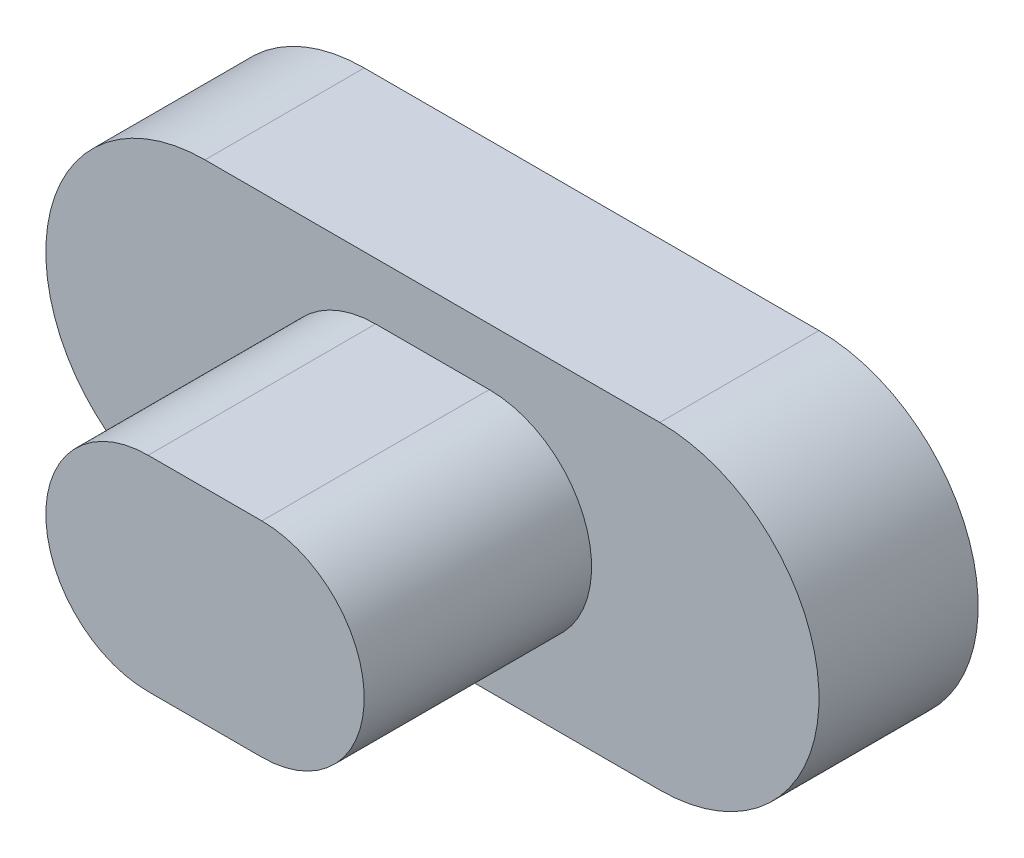
ISO-10303-21;
HEADER;
FILE_DESCRIPTION(('STEP AP214'),'2;1');
FILE_NAME('part.step','',(''),(''),'','','');
FILE_SCHEMA(('AUTOMOTIVE_DESIGN { 1 0 10303 214 1 1 1 1 }'));
ENDSEC;
DATA;
#1=APPLICATION_CONTEXT('core data for automotive mechanical design processes');
#2=APPLICATION_PROTOCOL_DEFINITION('international standard','automotive_design',2000,#1);
#3=PRODUCT_CONTEXT('',#1,'mechanical');
#4=PRODUCT('Part','Part','',(#3));
#5=PRODUCT_RELATED_PRODUCT_CATEGORY('part','',(#4));
#6=PRODUCT_DEFINITION_FORMATION('','',#4);
#7=PRODUCT_DEFINITION_CONTEXT('part definition',#1,'design');
#8=PRODUCT_DEFINITION('design','',#6,#7);
#9=PRODUCT_DEFINITION_SHAPE('','',#8);
#10=(LENGTH_UNIT() NAMED_UNIT(*) SI_UNIT(.MILLI.,.METRE.));
#11=(NAMED_UNIT(*) PLANE_ANGLE_UNIT() SI_UNIT($,.RADIAN.));
#12=(NAMED_UNIT(*) SI_UNIT($,.STERADIAN.) SOLID_ANGLE_UNIT());
#13=UNCERTAINTY_MEASURE_WITH_UNIT(LENGTH_MEASURE(1.E-05),#10,'distance_accuracy_value','');
#14=(GEOMETRIC_REPRESENTATION_CONTEXT(3) GLOBAL_UNCERTAINTY_ASSIGNED_CONTEXT((#13)) GLOBAL_UNIT_ASSIGNED_CONTEXT((#10,
#11,#12)) REPRESENTATION_CONTEXT('',''));
#15=CARTESIAN_POINT('',(0.,0.,0.));
#16=DIRECTION('',(0.,0.,1.));
#17=DIRECTION('',(1.,0.,0.));
#18=AXIS2_PLACEMENT_3D('',#15,#16,#17);
#19=CARTESIAN_POINT('',(-2.,0.,1.4));
#20=DIRECTION('',(0.,0.,-1.));
#21=DIRECTION('',(-1.,0.,0.));
#22=AXIS2_PLACEMENT_3D('',#19,#20,#21);
#23=CYLINDRICAL_SURFACE('',#22,1.4);
#24=CARTESIAN_POINT('',(-2.,0.,0.));
#25=DIRECTION('',(0.,0.,1.));
#26=DIRECTION('',(1.,0.,0.));
#27=AXIS2_PLACEMENT_3D('',#24,#25,#26);
#28=CIRCLE('',#27,1.4);
#29=CARTESIAN_POINT('',(-2.,1.4,0.));
#30=VERTEX_POINT('',#29);
#31=CARTESIAN_POINT('',(-2.,-1.4,0.));
#32=VERTEX_POINT('',#31);
#33=EDGE_CURVE('E224',#30,#32,#28,.T.);
#34=ORIENTED_EDGE('',*,*,#33,.T.);
#35=DIRECTION('',(0.,0.,-1.));
#36=VECTOR('',#35,1.);
#37=CARTESIAN_POINT('',(-2.,-1.4,1.4));
#38=LINE('',#37,#36);
#39=CARTESIAN_POINT('',(-2.,-1.4,1.4));
#40=VERTEX_POINT('',#39);
#41=EDGE_CURVE('E11',#40,#32,#38,.T.);
#42=ORIENTED_EDGE('',*,*,#41,.F.);
#43=CARTESIAN_POINT('',(-2.,0.,1.4));
#44=DIRECTION('',(0.,0.,1.));
#45=DIRECTION('',(1.,0.,0.));
#46=AXIS2_PLACEMENT_3D('',#43,#44,#45);
#47=CIRCLE('',#46,1.4);
#48=CARTESIAN_POINT('',(-2.,1.4,1.4));
#49=VERTEX_POINT('',#48);
#50=EDGE_CURVE('E225',#49,#40,#47,.T.);
#51=ORIENTED_EDGE('',*,*,#50,.F.);
#52=DIRECTION('',(0.,0.,-1.));
#53=VECTOR('',#52,1.);
#54=CARTESIAN_POINT('',(-2.,1.4,1.4));
#55=LINE('',#54,#53);
#56=EDGE_CURVE('E239',#49,#30,#55,.T.);
#57=ORIENTED_EDGE('',*,*,#56,.T.);
#58=EDGE_LOOP('',(#34,#42,#51,#57));
#59=FACE_BOUND('',#58,.T.);
#60=ADVANCED_FACE('F43',(#59),#23,.T.);
#61=CARTESIAN_POINT('',(-2.,-1.4,1.4));
#62=DIRECTION('',(0.,1.,0.));
#63=DIRECTION('',(-1.,0.,0.));
#64=AXIS2_PLACEMENT_3D('',#61,#62,#63);
#65=PLANE('',#64);
#66=DIRECTION('',(1.,0.,0.));
#67=VECTOR('',#66,1.);
#68=CARTESIAN_POINT('',(-2.,-1.4,0.));
#69=LINE('',#68,#67);
#70=CARTESIAN_POINT('',(2.,-1.4,0.));
#71=VERTEX_POINT('',#70);
#72=EDGE_CURVE('E243',#32,#71,#69,.T.);
#73=ORIENTED_EDGE('',*,*,#72,.T.);
#74=DIRECTION('',(0.,0.,-1.));
#75=VECTOR('',#74,1.);
#76=CARTESIAN_POINT('',(2.,-1.4,1.4));
#77=LINE('',#76,#75);
#78=CARTESIAN_POINT('',(2.,-1.4,1.4));
#79=VERTEX_POINT('',#78);
#80=EDGE_CURVE('E51',#79,#71,#77,.T.);
#81=ORIENTED_EDGE('',*,*,#80,.F.);
#82=DIRECTION('',(1.,0.,0.));
#83=VECTOR('',#82,1.);
#84=CARTESIAN_POINT('',(-2.,-1.4,1.4));
#85=LINE('',#84,#83);
#86=EDGE_CURVE('E229',#40,#79,#85,.T.);
#87=ORIENTED_EDGE('',*,*,#86,.F.);
#88=ORIENTED_EDGE('',*,*,#41,.T.);
#89=EDGE_LOOP('',(#73,#81,#87,#88));
#90=FACE_BOUND('',#89,.T.);
#91=ADVANCED_FACE('F279',(#90),#65,.F.);
#92=CARTESIAN_POINT('',(2.,0.,1.4));
#93=DIRECTION('',(0.,0.,-1.));
#94=DIRECTION('',(-1.,0.,0.));
#95=AXIS2_PLACEMENT_3D('',#92,#93,#94);
#96=CYLINDRICAL_SURFACE('',#95,1.4);
#97=CARTESIAN_POINT('',(2.,0.,0.));
#98=DIRECTION('',(0.,0.,1.));
#99=DIRECTION('',(1.,0.,0.));
#100=AXIS2_PLACEMENT_3D('',#97,#98,#99);
#101=CIRCLE('',#100,1.4);
#102=CARTESIAN_POINT('',(2.,1.4,0.));
#103=VERTEX_POINT('',#102);
#104=EDGE_CURVE('E246',#71,#103,#101,.T.);
#105=ORIENTED_EDGE('',*,*,#104,.T.);
#106=DIRECTION('',(0.,0.,-1.));
#107=VECTOR('',#106,1.);
#108=CARTESIAN_POINT('',(2.,1.4,1.4));
#109=LINE('',#108,#107);
#110=CARTESIAN_POINT('',(2.,1.4,1.4));
#111=VERTEX_POINT('',#110);
#112=EDGE_CURVE('E254',#111,#103,#109,.T.);
#113=ORIENTED_EDGE('',*,*,#112,.F.);
#114=CARTESIAN_POINT('',(2.,0.,1.4));
#115=DIRECTION('',(0.,0.,1.));
#116=DIRECTION('',(1.,0.,0.));
#117=AXIS2_PLACEMENT_3D('',#114,#115,#116);
#118=CIRCLE('',#117,1.4);
#119=EDGE_CURVE('E233',#79,#111,#118,.T.);
#120=ORIENTED_EDGE('',*,*,#119,.F.);
#121=ORIENTED_EDGE('',*,*,#80,.T.);
#122=EDGE_LOOP('',(#105,#113,#120,#121));
#123=FACE_BOUND('',#122,.T.);
#124=ADVANCED_FACE('F263',(#123),#96,.T.);
#125=CARTESIAN_POINT('',(-2.,1.4,1.4));
#126=DIRECTION('',(0.,-1.,0.));
#127=DIRECTION('',(1.,0.,0.));
#128=AXIS2_PLACEMENT_3D('',#125,#126,#127);
#129=PLANE('',#128);
#130=DIRECTION('',(-1.,0.,0.));
#131=VECTOR('',#130,1.);
#132=CARTESIAN_POINT('',(-2.,1.4,0.));
#133=LINE('',#132,#131);
#134=EDGE_CURVE('E230',#103,#30,#133,.T.);
#135=ORIENTED_EDGE('',*,*,#134,.T.);
#136=ORIENTED_EDGE('',*,*,#56,.F.);
#137=DIRECTION('',(-1.,0.,0.));
#138=VECTOR('',#137,1.);
#139=CARTESIAN_POINT('',(-2.,1.4,1.4));
#140=LINE('',#139,#138);
#141=EDGE_CURVE('E236',#111,#49,#140,.T.);
#142=ORIENTED_EDGE('',*,*,#141,.F.);
#143=ORIENTED_EDGE('',*,*,#112,.T.);
#144=EDGE_LOOP('',(#135,#136,#142,#143));
#145=FACE_BOUND('',#144,.T.);
#146=ADVANCED_FACE('F272',(#145),#129,.F.);
#147=CARTESIAN_POINT('',(-2.,0.,1.4));
#148=DIRECTION('',(0.,0.,1.));
#149=DIRECTION('',(1.,0.,0.));
#150=AXIS2_PLACEMENT_3D('',#147,#148,#149);
#151=PLANE('',#150);
#152=CARTESIAN_POINT('',(-0.5,0.,1.4));
#153=DIRECTION('',(0.,0.,1.));
#154=DIRECTION('',(1.,0.,0.));
#155=AXIS2_PLACEMENT_3D('',#152,#153,#154);
#156=CIRCLE('',#155,0.9);
#157=CARTESIAN_POINT('',(-0.5,0.9,1.4));
#158=VERTEX_POINT('',#157);
#159=CARTESIAN_POINT('',(-0.5,-0.9,1.4));
#160=VERTEX_POINT('',#159);
#161=EDGE_CURVE('E66',#158,#160,#156,.T.);
#162=ORIENTED_EDGE('',*,*,#161,.F.);
#163=DIRECTION('',(-1.,0.,0.));
#164=VECTOR('',#163,1.);
#165=CARTESIAN_POINT('',(-0.5,0.9,1.4));
#166=LINE('',#165,#164);
#167=CARTESIAN_POINT('',(0.5,0.9,1.4));
#168=VERTEX_POINT('',#167);
#169=EDGE_CURVE('E187',#168,#158,#166,.T.);
#170=ORIENTED_EDGE('',*,*,#169,.F.);
#171=CARTESIAN_POINT('',(0.5,0.,1.4));
#172=DIRECTION('',(0.,0.,1.));
#173=DIRECTION('',(1.,0.,0.));
#174=AXIS2_PLACEMENT_3D('',#171,#172,#173);
#175=CIRCLE('',#174,0.9);
#176=CARTESIAN_POINT('',(0.5,-0.9,1.4));
#177=VERTEX_POINT('',#176);
#178=EDGE_CURVE('E203',#177,#168,#175,.T.);
#179=ORIENTED_EDGE('',*,*,#178,.F.);
#180=DIRECTION('',(1.,0.,0.));
#181=VECTOR('',#180,1.);
#182=CARTESIAN_POINT('',(-0.5,-0.9,1.4));
#183=LINE('',#182,#181);
#184=EDGE_CURVE('E199',#160,#177,#183,.T.);
#185=ORIENTED_EDGE('',*,*,#184,.F.);
#186=EDGE_LOOP('',(#162,#170,#179,#185));
#187=FACE_BOUND('',#186,.T.);
#188=ORIENTED_EDGE('',*,*,#50,.T.);
#189=ORIENTED_EDGE('',*,*,#86,.T.);
#190=ORIENTED_EDGE('',*,*,#119,.T.);
#191=ORIENTED_EDGE('',*,*,#141,.T.);
#192=EDGE_LOOP('',(#188,#189,#190,#191));
#193=FACE_BOUND('',#192,.T.);
#194=ADVANCED_FACE('F278',(#187,#193),#151,.T.);
#195=CARTESIAN_POINT('',(-2.,0.,0.));
#196=DIRECTION('',(0.,0.,1.));
#197=DIRECTION('',(1.,0.,0.));
#198=AXIS2_PLACEMENT_3D('',#195,#196,#197);
#199=PLANE('',#198);
#200=DIRECTION('',(1.,0.,0.));
#201=VECTOR('',#200,1.);
#202=CARTESIAN_POINT('',(0.8,0.6,0.));
#203=LINE('',#202,#201);
#204=CARTESIAN_POINT('',(-0.8,0.6,0.));
#205=VERTEX_POINT('',#204);
#206=CARTESIAN_POINT('',(0.8,0.6,0.));
#207=VERTEX_POINT('',#206);
#208=EDGE_CURVE('E168',#205,#207,#203,.T.);
#209=ORIENTED_EDGE('',*,*,#208,.F.);
#210=DIRECTION('',(0.,1.,0.));
#211=VECTOR('',#210,1.);
#212=CARTESIAN_POINT('',(-0.8,0.6,0.));
#213=LINE('',#212,#211);
#214=CARTESIAN_POINT('',(-0.8,-0.6,0.));
#215=VERTEX_POINT('',#214);
#216=EDGE_CURVE('E58',#215,#205,#213,.T.);
#217=ORIENTED_EDGE('',*,*,#216,.F.);
#218=DIRECTION('',(-1.,0.,0.));
#219=VECTOR('',#218,1.);
#220=CARTESIAN_POINT('',(0.8,-0.6,0.));
#221=LINE('',#220,#219);
#222=CARTESIAN_POINT('',(0.8,-0.6,0.));
#223=VERTEX_POINT('',#222);
#224=EDGE_CURVE('E155',#223,#215,#221,.T.);
#225=ORIENTED_EDGE('',*,*,#224,.F.);
#226=DIRECTION('',(0.,-1.,0.));
#227=VECTOR('',#226,1.);
#228=CARTESIAN_POINT('',(0.8,0.6,0.));
#229=LINE('',#228,#227);
#230=EDGE_CURVE('E159',#207,#223,#229,.T.);
#231=ORIENTED_EDGE('',*,*,#230,.F.);
#232=EDGE_LOOP('',(#209,#217,#225,#231));
#233=FACE_BOUND('',#232,.T.);
#234=ORIENTED_EDGE('',*,*,#33,.F.);
#235=ORIENTED_EDGE('',*,*,#134,.F.);
#236=ORIENTED_EDGE('',*,*,#104,.F.);
#237=ORIENTED_EDGE('',*,*,#72,.F.);
#238=EDGE_LOOP('',(#234,#235,#236,#237));
#239=FACE_BOUND('',#238,.T.);
#240=ADVANCED_FACE('F269',(#233,#239),#199,.F.);
#241=CARTESIAN_POINT('',(-0.5,0.,3.4));
#242=DIRECTION('',(0.,0.,-1.));
#243=DIRECTION('',(-1.,0.,0.));
#244=AXIS2_PLACEMENT_3D('',#241,#242,#243);
#245=CYLINDRICAL_SURFACE('',#244,0.9);
#246=ORIENTED_EDGE('',*,*,#161,.T.);
#247=DIRECTION('',(0.,0.,-1.));
#248=VECTOR('',#247,1.);
#249=CARTESIAN_POINT('',(-0.5,-0.9,3.4));
#250=LINE('',#249,#248);
#251=CARTESIAN_POINT('',(-0.5,-0.9,3.4));
#252=VERTEX_POINT('',#251);
#253=EDGE_CURVE('E220',#252,#160,#250,.T.);
#254=ORIENTED_EDGE('',*,*,#253,.F.);
#255=CARTESIAN_POINT('',(-0.5,0.,3.4));
#256=DIRECTION('',(0.,0.,1.));
#257=DIRECTION('',(1.,0.,0.));
#258=AXIS2_PLACEMENT_3D('',#255,#256,#257);
#259=CIRCLE('',#258,0.9);
#260=CARTESIAN_POINT('',(-0.5,0.9,3.4));
#261=VERTEX_POINT('',#260);
#262=EDGE_CURVE('E182',#261,#252,#259,.T.);
#263=ORIENTED_EDGE('',*,*,#262,.F.);
#264=DIRECTION('',(0.,0.,-1.));
#265=VECTOR('',#264,1.);
#266=CARTESIAN_POINT('',(-0.5,0.9,3.4));
#267=LINE('',#266,#265);
#268=EDGE_CURVE('E196',#261,#158,#267,.T.);
#269=ORIENTED_EDGE('',*,*,#268,.T.);
#270=EDGE_LOOP('',(#246,#254,#263,#269));
#271=FACE_BOUND('',#270,.T.);
#272=ADVANCED_FACE('F291',(#271),#245,.T.);
#273=CARTESIAN_POINT('',(-0.5,-0.9,3.4));
#274=DIRECTION('',(0.,1.,0.));
#275=DIRECTION('',(-1.,0.,0.));
#276=AXIS2_PLACEMENT_3D('',#273,#274,#275);
#277=PLANE('',#276);
#278=ORIENTED_EDGE('',*,*,#184,.T.);
#279=DIRECTION('',(0.,0.,-1.));
#280=VECTOR('',#279,1.);
#281=CARTESIAN_POINT('',(0.5,-0.9,3.4));
#282=LINE('',#281,#280);
#283=CARTESIAN_POINT('',(0.5,-0.9,3.4));
#284=VERTEX_POINT('',#283);
#285=EDGE_CURVE('E216',#284,#177,#282,.T.);
#286=ORIENTED_EDGE('',*,*,#285,.F.);
#287=DIRECTION('',(1.,0.,0.));
#288=VECTOR('',#287,1.);
#289=CARTESIAN_POINT('',(-0.5,-0.9,3.4));
#290=LINE('',#289,#288);
#291=EDGE_CURVE('E186',#252,#284,#290,.T.);
#292=ORIENTED_EDGE('',*,*,#291,.F.);
#293=ORIENTED_EDGE('',*,*,#253,.T.);
#294=EDGE_LOOP('',(#278,#286,#292,#293));
#295=FACE_BOUND('',#294,.T.);
#296=ADVANCED_FACE('F297',(#295),#277,.F.);
#297=CARTESIAN_POINT('',(0.5,0.,3.4));
#298=DIRECTION('',(0.,0.,-1.));
#299=DIRECTION('',(-1.,0.,0.));
#300=AXIS2_PLACEMENT_3D('',#297,#298,#299);
#301=CYLINDRICAL_SURFACE('',#300,0.9);
#302=ORIENTED_EDGE('',*,*,#178,.T.);
#303=DIRECTION('',(0.,0.,-1.));
#304=VECTOR('',#303,1.);
#305=CARTESIAN_POINT('',(0.5,0.9,3.4));
#306=LINE('',#305,#304);
#307=CARTESIAN_POINT('',(0.5,0.9,3.4));
#308=VERTEX_POINT('',#307);
#309=EDGE_CURVE('E212',#308,#168,#306,.T.);
#310=ORIENTED_EDGE('',*,*,#309,.F.);
#311=CARTESIAN_POINT('',(0.5,0.,3.4));
#312=DIRECTION('',(0.,0.,1.));
#313=DIRECTION('',(1.,0.,0.));
#314=AXIS2_PLACEMENT_3D('',#311,#312,#313);
#315=CIRCLE('',#314,0.9);
#316=EDGE_CURVE('E190',#284,#308,#315,.T.);
#317=ORIENTED_EDGE('',*,*,#316,.F.);
#318=ORIENTED_EDGE('',*,*,#285,.T.);
#319=EDGE_LOOP('',(#302,#310,#317,#318));
#320=FACE_BOUND('',#319,.T.);
#321=ADVANCED_FACE('F301',(#320),#301,.T.);
#322=CARTESIAN_POINT('',(-0.5,0.9,3.4));
#323=DIRECTION('',(0.,-1.,0.));
#324=DIRECTION('',(1.,0.,0.));
#325=AXIS2_PLACEMENT_3D('',#322,#323,#324);
#326=PLANE('',#325);
#327=ORIENTED_EDGE('',*,*,#169,.T.);
#328=ORIENTED_EDGE('',*,*,#268,.F.);
#329=DIRECTION('',(-1.,0.,0.));
#330=VECTOR('',#329,1.);
#331=CARTESIAN_POINT('',(-0.5,0.9,3.4));
#332=LINE('',#331,#330);
#333=EDGE_CURVE('E193',#308,#261,#332,.T.);
#334=ORIENTED_EDGE('',*,*,#333,.F.);
#335=ORIENTED_EDGE('',*,*,#309,.T.);
#336=EDGE_LOOP('',(#327,#328,#334,#335));
#337=FACE_BOUND('',#336,.T.);
#338=ADVANCED_FACE('F305',(#337),#326,.F.);
#339=CARTESIAN_POINT('',(-0.5,0.,3.4));
#340=DIRECTION('',(0.,0.,1.));
#341=DIRECTION('',(1.,0.,0.));
#342=AXIS2_PLACEMENT_3D('',#339,#340,#341);
#343=PLANE('',#342);
#344=ORIENTED_EDGE('',*,*,#262,.T.);
#345=ORIENTED_EDGE('',*,*,#291,.T.);
#346=ORIENTED_EDGE('',*,*,#316,.T.);
#347=ORIENTED_EDGE('',*,*,#333,.T.);
#348=EDGE_LOOP('',(#344,#345,#346,#347));
#349=FACE_BOUND('',#348,.T.);
#350=ADVANCED_FACE('F309',(#349),#343,.T.);
#351=CARTESIAN_POINT('',(-0.8,0.6,2.));
#352=DIRECTION('',(-1.,0.,0.));
#353=DIRECTION('',(0.,-1.,0.));
#354=AXIS2_PLACEMENT_3D('',#351,#352,#353);
#355=PLANE('',#354);
#356=ORIENTED_EDGE('',*,*,#216,.T.);
#357=DIRECTION('',(0.,0.,-1.));
#358=VECTOR('',#357,1.);
#359=CARTESIAN_POINT('',(-0.8,0.6,2.));
#360=LINE('',#359,#358);
#361=CARTESIAN_POINT('',(-0.8,0.6,2.));
#362=VERTEX_POINT('',#361);
#363=EDGE_CURVE('E130',#362,#205,#360,.T.);
#364=ORIENTED_EDGE('',*,*,#363,.F.);
#365=DIRECTION('',(0.,1.,0.));
#366=VECTOR('',#365,1.);
#367=CARTESIAN_POINT('',(-0.8,0.6,2.));
#368=LINE('',#367,#366);
#369=CARTESIAN_POINT('',(-0.8,-0.6,2.));
#370=VERTEX_POINT('',#369);
#371=EDGE_CURVE('E134',#370,#362,#368,.T.);
#372=ORIENTED_EDGE('',*,*,#371,.F.);
#373=DIRECTION('',(0.,0.,-1.));
#374=VECTOR('',#373,1.);
#375=CARTESIAN_POINT('',(-0.8,-0.6,2.));
#376=LINE('',#375,#374);
#377=EDGE_CURVE('E174',#370,#215,#376,.T.);
#378=ORIENTED_EDGE('',*,*,#377,.T.);
#379=EDGE_LOOP('',(#356,#364,#372,#378));
#380=FACE_BOUND('',#379,.T.);
#381=ADVANCED_FACE('F132',(#380),#355,.F.);
#382=CARTESIAN_POINT('',(0.8,-0.6,2.));
#383=DIRECTION('',(0.,-1.,0.));
#384=DIRECTION('',(0.,0.,-1.));
#385=AXIS2_PLACEMENT_3D('',#382,#383,#384);
#386=PLANE('',#385);
#387=ORIENTED_EDGE('',*,*,#224,.T.);
#388=ORIENTED_EDGE('',*,*,#377,.F.);
#389=DIRECTION('',(-1.,0.,0.));
#390=VECTOR('',#389,1.);
#391=CARTESIAN_POINT('',(0.8,-0.6,2.));
#392=LINE('',#391,#390);
#393=CARTESIAN_POINT('',(0.8,-0.6,2.));
#394=VERTEX_POINT('',#393);
#395=EDGE_CURVE('E141',#394,#370,#392,.T.);
#396=ORIENTED_EDGE('',*,*,#395,.F.);
#397=DIRECTION('',(0.,0.,-1.));
#398=VECTOR('',#397,1.);
#399=CARTESIAN_POINT('',(0.8,-0.6,2.));
#400=LINE('',#399,#398);
#401=EDGE_CURVE('E177',#394,#223,#400,.T.);
#402=ORIENTED_EDGE('',*,*,#401,.T.);
#403=EDGE_LOOP('',(#387,#388,#396,#402));
#404=FACE_BOUND('',#403,.T.);
#405=ADVANCED_FACE('F316',(#404),#386,.F.);
#406=CARTESIAN_POINT('',(0.8,0.6,2.));
#407=DIRECTION('',(1.,0.,0.));
#408=DIRECTION('',(0.,1.,0.));
#409=AXIS2_PLACEMENT_3D('',#406,#407,#408);
#410=PLANE('',#409);
#411=ORIENTED_EDGE('',*,*,#230,.T.);
#412=ORIENTED_EDGE('',*,*,#401,.F.);
#413=DIRECTION('',(0.,-1.,0.));
#414=VECTOR('',#413,1.);
#415=CARTESIAN_POINT('',(0.8,0.6,2.));
#416=LINE('',#415,#414);
#417=CARTESIAN_POINT('',(0.8,0.6,2.));
#418=VERTEX_POINT('',#417);
#419=EDGE_CURVE('E150',#418,#394,#416,.T.);
#420=ORIENTED_EDGE('',*,*,#419,.F.);
#421=DIRECTION('',(0.,0.,-1.));
#422=VECTOR('',#421,1.);
#423=CARTESIAN_POINT('',(0.8,0.6,2.));
#424=LINE('',#423,#422);
#425=EDGE_CURVE('E140',#418,#207,#424,.T.);
#426=ORIENTED_EDGE('',*,*,#425,.T.);
#427=EDGE_LOOP('',(#411,#412,#420,#426));
#428=FACE_BOUND('',#427,.T.);
#429=ADVANCED_FACE('F319',(#428),#410,.F.);
#430=CARTESIAN_POINT('',(0.8,0.6,2.));
#431=DIRECTION('',(0.,1.,0.));
#432=DIRECTION('',(0.,0.,1.));
#433=AXIS2_PLACEMENT_3D('',#430,#431,#432);
#434=PLANE('',#433);
#435=ORIENTED_EDGE('',*,*,#208,.T.);
#436=ORIENTED_EDGE('',*,*,#425,.F.);
#437=DIRECTION('',(1.,0.,0.));
#438=VECTOR('',#437,1.);
#439=CARTESIAN_POINT('',(0.8,0.6,2.));
#440=LINE('',#439,#438);
#441=EDGE_CURVE('E144',#362,#418,#440,.T.);
#442=ORIENTED_EDGE('',*,*,#441,.F.);
#443=ORIENTED_EDGE('',*,*,#363,.T.);
#444=EDGE_LOOP('',(#435,#436,#442,#443));
#445=FACE_BOUND('',#444,.T.);
#446=ADVANCED_FACE('F145',(#445),#434,.F.);
#447=CARTESIAN_POINT('',(0.,0.,2.));
#448=DIRECTION('',(0.,0.,-1.));
#449=DIRECTION('',(-1.,0.,0.));
#450=AXIS2_PLACEMENT_3D('',#447,#448,#449);
#451=PLANE('',#450);
#452=ORIENTED_EDGE('',*,*,#371,.T.);
#453=ORIENTED_EDGE('',*,*,#441,.T.);
#454=ORIENTED_EDGE('',*,*,#419,.T.);
#455=ORIENTED_EDGE('',*,*,#395,.T.);
#456=EDGE_LOOP('',(#452,#453,#454,#455));
#457=FACE_BOUND('',#456,.T.);
#458=ADVANCED_FACE('F152',(#457),#451,.T.);
#459=CLOSED_SHELL('',(#60,#91,#124,#146,#194,#240,#272,#296,#321,#338,#350,#381,#405,#429,#446,#458));
#460=MANIFOLD_SOLID_BREP('B2',#459);
#461=ADVANCED_BREP_SHAPE_REPRESENTATION('',(#18,#460),#14);
#462=SHAPE_DEFINITION_REPRESENTATION(#9,#461);
ENDSEC;
END-ISO-10303-21;
